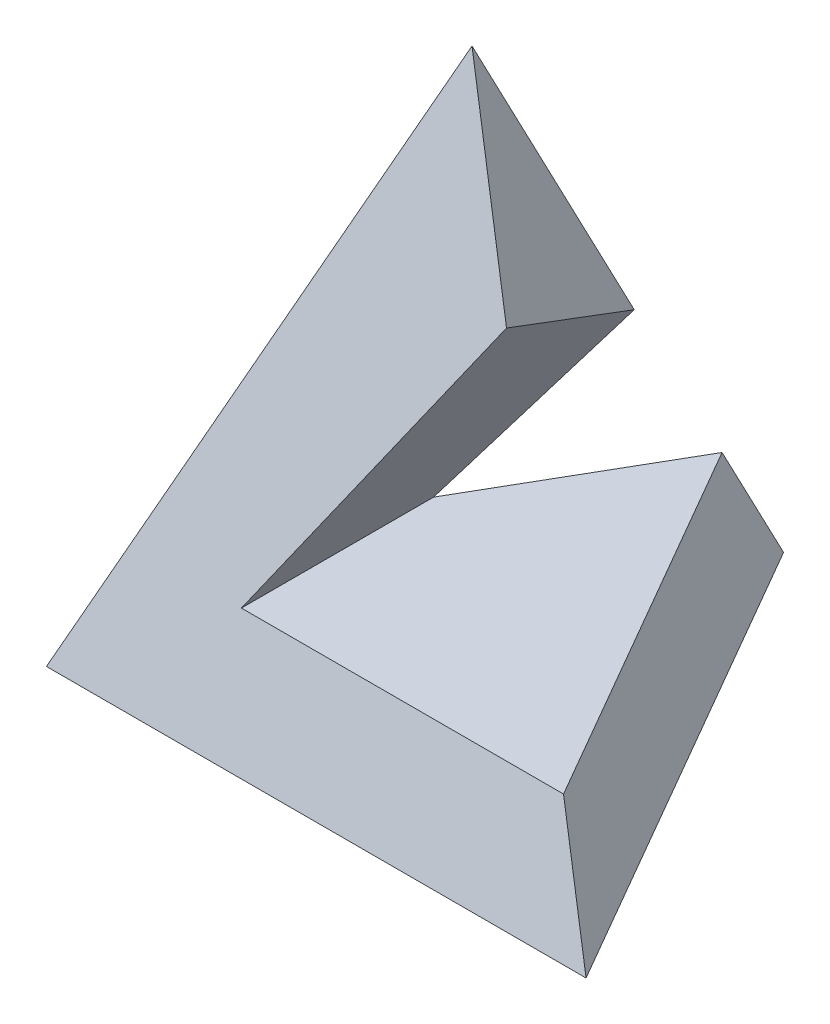
ISO-10303-21;
HEADER;
FILE_DESCRIPTION(('STEP AP214'),'2;1');
FILE_NAME('part.step','',(''),(''),'','','');
FILE_SCHEMA(('AUTOMOTIVE_DESIGN { 1 0 10303 214 1 1 1 1 }'));
ENDSEC;
DATA;
#1=APPLICATION_CONTEXT('core data for automotive mechanical design processes');
#2=APPLICATION_PROTOCOL_DEFINITION('international standard','automotive_design',2000,#1);
#3=PRODUCT_CONTEXT('',#1,'mechanical');
#4=PRODUCT('Part','Part','',(#3));
#5=PRODUCT_RELATED_PRODUCT_CATEGORY('part','',(#4));
#6=PRODUCT_DEFINITION_FORMATION('','',#4);
#7=PRODUCT_DEFINITION_CONTEXT('part definition',#1,'design');
#8=PRODUCT_DEFINITION('design','',#6,#7);
#9=PRODUCT_DEFINITION_SHAPE('','',#8);
#10=(LENGTH_UNIT() NAMED_UNIT(*) SI_UNIT(.MILLI.,.METRE.));
#11=(NAMED_UNIT(*) PLANE_ANGLE_UNIT() SI_UNIT($,.RADIAN.));
#12=(NAMED_UNIT(*) SI_UNIT($,.STERADIAN.) SOLID_ANGLE_UNIT());
#13=UNCERTAINTY_MEASURE_WITH_UNIT(LENGTH_MEASURE(1.E-05),#10,'distance_accuracy_value','');
#14=(GEOMETRIC_REPRESENTATION_CONTEXT(3) GLOBAL_UNCERTAINTY_ASSIGNED_CONTEXT((#13)) GLOBAL_UNIT_ASSIGNED_CONTEXT((#10,
#11,#12)) REPRESENTATION_CONTEXT('',''));
#15=CARTESIAN_POINT('',(0.,0.,0.));
#16=DIRECTION('',(0.,0.,1.));
#17=DIRECTION('',(1.,0.,0.));
#18=AXIS2_PLACEMENT_3D('',#15,#16,#17);
#19=CARTESIAN_POINT('',(-16.1412660483577,4.88485683042404,-9.31916429808069));
#20=DIRECTION('',(-0.837731565607714,0.253524026433914,-0.483664544912261));
#21=DIRECTION('',(-0.5,0.,0.866025403784439));
#22=AXIS2_PLACEMENT_3D('',#19,#20,#21);
#23=PLANE('',#22);
#24=DIRECTION('',(0.480599128827825,0.762830604042186,-0.432566696483409));
#25=VECTOR('',#24,1.);
#26=CARTESIAN_POINT('',(-17.6672431014767,8.38554653637559,-4.84112653797923));
#27=LINE('',#26,#25);
#28=CARTESIAN_POINT('',(-13.5,15.,-8.59188361122982));
#29=VERTEX_POINT('',#28);
#30=CARTESIAN_POINT('',(0.,36.4278647980214,-20.7426555378641));
#31=VERTEX_POINT('',#30);
#32=EDGE_CURVE('E58',#29,#31,#27,.T.);
#33=ORIENTED_EDGE('',*,*,#32,.F.);
#34=DIRECTION('',(0.5,0.,-0.866025403784439));
#35=VECTOR('',#34,1.);
#36=CARTESIAN_POINT('',(-13.8453947368421,15.,-7.99364237835242));
#37=LINE('',#36,#35);
#38=CARTESIAN_POINT('',(0.,15.,-31.9745695134097));
#39=VERTEX_POINT('',#38);
#40=EDGE_CURVE('E243',#29,#39,#37,.T.);
#41=ORIENTED_EDGE('',*,*,#40,.T.);
#42=DIRECTION('',(0.,-0.885699076896105,-0.464259782002907));
#43=VECTOR('',#42,1.);
#44=CARTESIAN_POINT('',(0.,76.,0.));
#45=LINE('',#44,#43);
#46=CARTESIAN_POINT('',(0.,0.,-39.8371685740842));
#47=VERTEX_POINT('',#46);
#48=EDGE_CURVE('E122',#39,#47,#45,.T.);
#49=ORIENTED_EDGE('',*,*,#48,.T.);
#50=DIRECTION('',(-0.5,0.,0.866025403784439));
#51=VECTOR('',#50,1.);
#52=CARTESIAN_POINT('',(0.,0.,-39.8371685740842));
#53=LINE('',#52,#51);
#54=CARTESIAN_POINT('',(-34.5,0.,19.9185842870421));
#55=VERTEX_POINT('',#54);
#56=EDGE_CURVE('E150',#47,#55,#53,.T.);
#57=ORIENTED_EDGE('',*,*,#56,.T.);
#58=DIRECTION('',(-0.402060765169943,-0.885699076896105,0.232129891001453));
#59=VECTOR('',#58,1.);
#60=CARTESIAN_POINT('',(0.,76.,0.));
#61=LINE('',#60,#59);
#62=CARTESIAN_POINT('',(0.,76.,0.));
#63=VERTEX_POINT('',#62);
#64=EDGE_CURVE('E105',#63,#55,#61,.T.);
#65=ORIENTED_EDGE('',*,*,#64,.F.);
#66=EDGE_CURVE('E65',#63,#31,#45,.T.);
#67=ORIENTED_EDGE('',*,*,#66,.T.);
#68=EDGE_LOOP('',(#33,#41,#49,#57,#65,#67));
#69=FACE_BOUND('',#68,.T.);
#70=ADVANCED_FACE('F42',(#69),#23,.T.);
#71=CARTESIAN_POINT('',(0.,4.88485683042404,18.6383285961614));
#72=DIRECTION('',(0.,0.253524026433914,0.967329089824521));
#73=DIRECTION('',(0.,-0.967329089824521,0.253524026433914));
#74=AXIS2_PLACEMENT_3D('',#71,#72,#73);
#75=PLANE('',#74);
#76=DIRECTION('',(0.402060765169943,-0.885699076896105,0.232129891001453));
#77=VECTOR('',#76,1.);
#78=CARTESIAN_POINT('',(0.,76.,0.));
#79=LINE('',#78,#77);
#80=CARTESIAN_POINT('',(27.6907894736842,15.,15.9872847567048));
#81=VERTEX_POINT('',#80);
#82=CARTESIAN_POINT('',(34.5,0.,19.9185842870421));
#83=VERTEX_POINT('',#82);
#84=EDGE_CURVE('E103',#81,#83,#79,.T.);
#85=ORIENTED_EDGE('',*,*,#84,.F.);
#86=DIRECTION('',(-1.,0.,0.));
#87=VECTOR('',#86,1.);
#88=CARTESIAN_POINT('',(0.,15.,15.9872847567048));
#89=LINE('',#88,#87);
#90=CARTESIAN_POINT('',(-13.5,15.,15.9872847567048));
#91=VERTEX_POINT('',#90);
#92=EDGE_CURVE('E100',#81,#91,#89,.T.);
#93=ORIENTED_EDGE('',*,*,#92,.T.);
#94=DIRECTION('',(-0.520409042538683,-0.826018859495309,0.216488503625575));
#95=VECTOR('',#94,1.);
#96=CARTESIAN_POINT('',(-14.4907013745977,13.427509991845,16.3994133720728));
#97=LINE('',#96,#95);
#98=CARTESIAN_POINT('',(10.4407894736842,53.,6.0279926131838));
#99=VERTEX_POINT('',#98);
#100=EDGE_CURVE('E91',#99,#91,#97,.T.);
#101=ORIENTED_EDGE('',*,*,#100,.F.);
#102=EDGE_CURVE('E93',#63,#99,#79,.T.);
#103=ORIENTED_EDGE('',*,*,#102,.F.);
#104=ORIENTED_EDGE('',*,*,#64,.T.);
#105=DIRECTION('',(1.,0.,0.));
#106=VECTOR('',#105,1.);
#107=CARTESIAN_POINT('',(-34.5,0.,19.9185842870421));
#108=LINE('',#107,#106);
#109=EDGE_CURVE('E124',#55,#83,#108,.T.);
#110=ORIENTED_EDGE('',*,*,#109,.T.);
#111=EDGE_LOOP('',(#85,#93,#101,#103,#104,#110));
#112=FACE_BOUND('',#111,.T.);
#113=ADVANCED_FACE('F98',(#112),#75,.T.);
#114=CARTESIAN_POINT('',(16.1412660483577,4.88485683042404,-9.31916429808068));
#115=DIRECTION('',(0.837731565607714,0.253524026433914,-0.483664544912261));
#116=DIRECTION('',(-0.5,0.,-0.866025403784439));
#117=AXIS2_PLACEMENT_3D('',#114,#115,#116);
#118=PLANE('',#117);
#119=ORIENTED_EDGE('',*,*,#48,.F.);
#120=DIRECTION('',(0.5,0.,0.866025403784439));
#121=VECTOR('',#120,1.);
#122=CARTESIAN_POINT('',(13.8453947368421,15.,-7.99364237835241));
#123=LINE('',#122,#121);
#124=EDGE_CURVE('E12',#39,#81,#123,.T.);
#125=ORIENTED_EDGE('',*,*,#124,.T.);
#126=ORIENTED_EDGE('',*,*,#84,.T.);
#127=DIRECTION('',(-0.5,0.,-0.866025403784439));
#128=VECTOR('',#127,1.);
#129=CARTESIAN_POINT('',(34.5,0.,19.9185842870421));
#130=LINE('',#129,#128);
#131=EDGE_CURVE('E134',#83,#47,#130,.T.);
#132=ORIENTED_EDGE('',*,*,#131,.T.);
#133=EDGE_LOOP('',(#119,#125,#126,#132));
#134=FACE_BOUND('',#133,.T.);
#135=ADVANCED_FACE('F169',(#134),#118,.T.);
#136=CARTESIAN_POINT('',(0.,0.,0.));
#137=DIRECTION('',(0.,1.,0.));
#138=DIRECTION('',(0.,0.,1.));
#139=AXIS2_PLACEMENT_3D('',#136,#137,#138);
#140=PLANE('',#139);
#141=ORIENTED_EDGE('',*,*,#131,.F.);
#142=ORIENTED_EDGE('',*,*,#109,.F.);
#143=ORIENTED_EDGE('',*,*,#56,.F.);
#144=EDGE_LOOP('',(#141,#142,#143));
#145=FACE_BOUND('',#144,.T.);
#146=ADVANCED_FACE('F159',(#145),#140,.F.);
#147=DIRECTION('',(0.31475681872739,0.499597522662656,0.8070504695581));
#148=VECTOR('',#147,1.);
#149=CARTESIAN_POINT('',(-0.459199074508646,35.6990014140253,-21.9200623695929));
#150=LINE('',#149,#148);
#151=EDGE_CURVE('E51',#31,#99,#150,.T.);
#152=ORIENTED_EDGE('',*,*,#151,.F.);
#153=ORIENTED_EDGE('',*,*,#66,.F.);
#154=ORIENTED_EDGE('',*,*,#102,.T.);
#155=EDGE_LOOP('',(#152,#153,#154));
#156=FACE_BOUND('',#155,.T.);
#157=ADVANCED_FACE('F44',(#156),#118,.T.);
#158=CARTESIAN_POINT('',(27.6907894736842,15.,-38.));
#159=DIRECTION('',(0.,1.,0.));
#160=DIRECTION('',(-1.,0.,0.));
#161=AXIS2_PLACEMENT_3D('',#158,#159,#160);
#162=PLANE('',#161);
#163=DIRECTION('',(0.,0.,1.));
#164=VECTOR('',#163,1.);
#165=CARTESIAN_POINT('',(-13.5,15.,-38.));
#166=LINE('',#165,#164);
#167=EDGE_CURVE('E101',#29,#91,#166,.T.);
#168=ORIENTED_EDGE('',*,*,#167,.T.);
#169=ORIENTED_EDGE('',*,*,#92,.F.);
#170=ORIENTED_EDGE('',*,*,#124,.F.);
#171=ORIENTED_EDGE('',*,*,#40,.F.);
#172=EDGE_LOOP('',(#168,#169,#170,#171));
#173=FACE_BOUND('',#172,.T.);
#174=ADVANCED_FACE('F170',(#173),#162,.T.);
#175=CARTESIAN_POINT('',(10.4407894736842,53.,-38.));
#176=DIRECTION('',(-0.84608359033008,0.533050239821877,0.));
#177=DIRECTION('',(-0.533050239821877,-0.84608359033008,0.));
#178=AXIS2_PLACEMENT_3D('',#175,#176,#177);
#179=PLANE('',#178);
#180=ORIENTED_EDGE('',*,*,#32,.T.);
#181=ORIENTED_EDGE('',*,*,#151,.T.);
#182=ORIENTED_EDGE('',*,*,#100,.T.);
#183=ORIENTED_EDGE('',*,*,#167,.F.);
#184=EDGE_LOOP('',(#180,#181,#182,#183));
#185=FACE_BOUND('',#184,.T.);
#186=ADVANCED_FACE('F90',(#185),#179,.F.);
#187=CLOSED_SHELL('',(#70,#113,#135,#146,#157,#174,#186));
#188=MANIFOLD_SOLID_BREP('B2',#187);
#189=ADVANCED_BREP_SHAPE_REPRESENTATION('',(#18,#188),#14);
#190=SHAPE_DEFINITION_REPRESENTATION(#9,#189);
ENDSEC;
END-ISO-10303-21;
